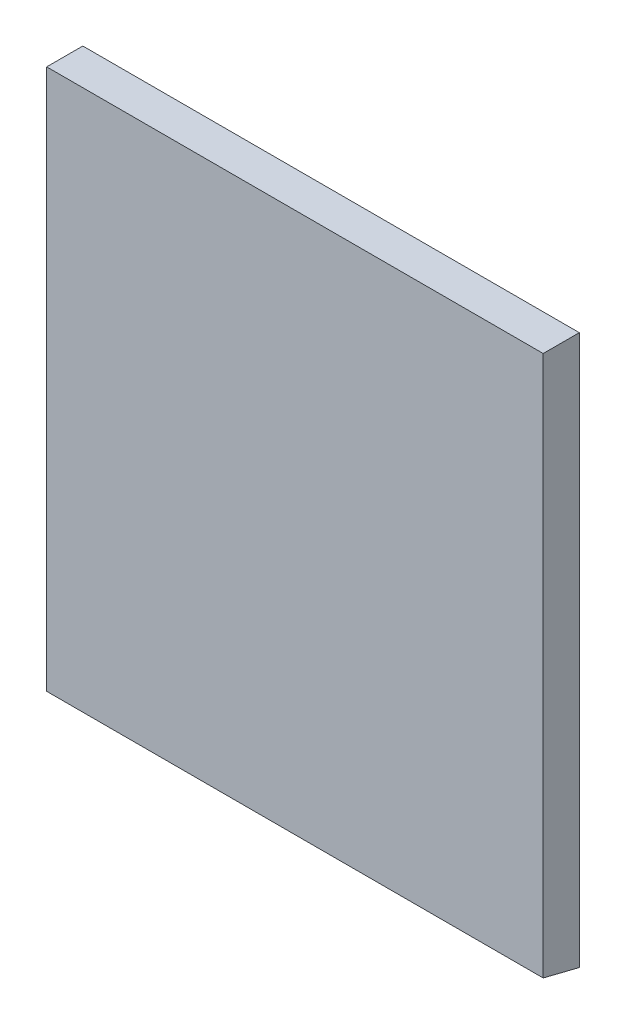
ISO-10303-21;
HEADER;
FILE_DESCRIPTION(('STEP AP214'),'2;1');
FILE_NAME('part.step','',(''),(''),'','','');
FILE_SCHEMA(('AUTOMOTIVE_DESIGN { 1 0 10303 214 1 1 1 1 }'));
ENDSEC;
DATA;
#1=APPLICATION_CONTEXT('core data for automotive mechanical design processes');
#2=APPLICATION_PROTOCOL_DEFINITION('international standard','automotive_design',2000,#1);
#3=PRODUCT_CONTEXT('',#1,'mechanical');
#4=PRODUCT('Part','Part','',(#3));
#5=PRODUCT_RELATED_PRODUCT_CATEGORY('part','',(#4));
#6=PRODUCT_DEFINITION_FORMATION('','',#4);
#7=PRODUCT_DEFINITION_CONTEXT('part definition',#1,'design');
#8=PRODUCT_DEFINITION('design','',#6,#7);
#9=PRODUCT_DEFINITION_SHAPE('','',#8);
#10=(LENGTH_UNIT() NAMED_UNIT(*) SI_UNIT(.MILLI.,.METRE.));
#11=(NAMED_UNIT(*) PLANE_ANGLE_UNIT() SI_UNIT($,.RADIAN.));
#12=(NAMED_UNIT(*) SI_UNIT($,.STERADIAN.) SOLID_ANGLE_UNIT());
#13=UNCERTAINTY_MEASURE_WITH_UNIT(LENGTH_MEASURE(1.E-05),#10,'distance_accuracy_value','');
#14=(GEOMETRIC_REPRESENTATION_CONTEXT(3) GLOBAL_UNCERTAINTY_ASSIGNED_CONTEXT((#13)) GLOBAL_UNIT_ASSIGNED_CONTEXT((#10,
#11,#12)) REPRESENTATION_CONTEXT('',''));
#15=CARTESIAN_POINT('',(0.,0.,0.));
#16=DIRECTION('',(0.,0.,1.));
#17=DIRECTION('',(1.,0.,0.));
#18=AXIS2_PLACEMENT_3D('',#15,#16,#17);
#19=CARTESIAN_POINT('',(43.66,106.923746647894,-143.154202423773));
#20=DIRECTION('',(0.,0.970295726275996,-0.24192189559967));
#21=DIRECTION('',(0.,0.24192189559967,0.970295726275996));
#22=AXIS2_PLACEMENT_3D('',#19,#20,#21);
#23=PLANE('',#22);
#24=DIRECTION('',(0.,-0.24192189559967,-0.970295726275996));
#25=VECTOR('',#24,1.);
#26=CARTESIAN_POINT('',(43.65,94.3012173907014,-193.780402101521));
#27=LINE('',#26,#25);
#28=CARTESIAN_POINT('',(43.65,108.506979465948,-136.804202423773));
#29=VERTEX_POINT('',#28);
#30=CARTESIAN_POINT('',(43.65,106.923746647894,-143.154202423773));
#31=VERTEX_POINT('',#30);
#32=EDGE_CURVE('E37',#29,#31,#27,.T.);
#33=ORIENTED_EDGE('',*,*,#32,.F.);
#34=DIRECTION('',(1.,0.,0.));
#35=VECTOR('',#34,1.);
#36=CARTESIAN_POINT('',(-50.,108.506979465948,-136.804202423773));
#37=LINE('',#36,#35);
#38=CARTESIAN_POINT('',(-43.65,108.506979465948,-136.804202423773));
#39=VERTEX_POINT('',#38);
#40=EDGE_CURVE('E11',#39,#29,#37,.T.);
#41=ORIENTED_EDGE('',*,*,#40,.F.);
#42=DIRECTION('',(0.,0.24192189559967,0.970295726275996));
#43=VECTOR('',#42,1.);
#44=CARTESIAN_POINT('',(-43.65,94.3012173907014,-193.780402101521));
#45=LINE('',#44,#43);
#46=CARTESIAN_POINT('',(-43.65,106.923746647894,-143.154202423773));
#47=VERTEX_POINT('',#46);
#48=EDGE_CURVE('E42',#47,#39,#45,.T.);
#49=ORIENTED_EDGE('',*,*,#48,.F.);
#50=DIRECTION('',(1.,0.,0.));
#51=VECTOR('',#50,1.);
#52=CARTESIAN_POINT('',(-50.,106.923746647894,-143.154202423773));
#53=LINE('',#52,#51);
#54=EDGE_CURVE('E100',#47,#31,#53,.T.);
#55=ORIENTED_EDGE('',*,*,#54,.T.);
#56=EDGE_LOOP('',(#33,#41,#49,#55));
#57=FACE_BOUND('',#56,.T.);
#58=ADVANCED_FACE('F34',(#57),#23,.F.);
#59=CARTESIAN_POINT('',(43.65,-0.00999999999995449,-170.265974623788));
#60=DIRECTION('',(1.,0.,0.));
#61=DIRECTION('',(0.,0.,1.));
#62=AXIS2_PLACEMENT_3D('',#59,#60,#61);
#63=PLANE('',#62);
#64=ORIENTED_EDGE('',*,*,#32,.T.);
#65=DIRECTION('',(0.,-1.,0.));
#66=VECTOR('',#65,1.);
#67=CARTESIAN_POINT('',(43.65,203.6,-143.154202423773));
#68=LINE('',#67,#66);
#69=CARTESIAN_POINT('',(43.65,203.6,-143.154202423773));
#70=VERTEX_POINT('',#69);
#71=EDGE_CURVE('E90',#70,#31,#68,.T.);
#72=ORIENTED_EDGE('',*,*,#71,.F.);
#73=DIRECTION('',(0.,0.,-1.));
#74=VECTOR('',#73,1.);
#75=CARTESIAN_POINT('',(43.65,203.6,-120.654202423773));
#76=LINE('',#75,#74);
#77=CARTESIAN_POINT('',(43.65,203.6,-136.804202423773));
#78=VERTEX_POINT('',#77);
#79=EDGE_CURVE('E79',#78,#70,#76,.T.);
#80=ORIENTED_EDGE('',*,*,#79,.F.);
#81=DIRECTION('',(0.,1.,0.));
#82=VECTOR('',#81,1.);
#83=CARTESIAN_POINT('',(43.65,0.,-136.804202423773));
#84=LINE('',#83,#82);
#85=EDGE_CURVE('E50',#29,#78,#84,.T.);
#86=ORIENTED_EDGE('',*,*,#85,.F.);
#87=EDGE_LOOP('',(#64,#72,#80,#86));
#88=FACE_BOUND('',#87,.T.);
#89=ADVANCED_FACE('F89',(#88),#63,.T.);
#90=CARTESIAN_POINT('',(-43.65,-0.00999999999995449,-170.265974623788));
#91=DIRECTION('',(-1.,0.,0.));
#92=DIRECTION('',(0.,0.,-1.));
#93=AXIS2_PLACEMENT_3D('',#90,#91,#92);
#94=PLANE('',#93);
#95=ORIENTED_EDGE('',*,*,#48,.T.);
#96=DIRECTION('',(0.,1.,0.));
#97=VECTOR('',#96,1.);
#98=CARTESIAN_POINT('',(-43.65,0.,-136.804202423773));
#99=LINE('',#98,#97);
#100=CARTESIAN_POINT('',(-43.65,203.6,-136.804202423773));
#101=VERTEX_POINT('',#100);
#102=EDGE_CURVE('E56',#39,#101,#99,.T.);
#103=ORIENTED_EDGE('',*,*,#102,.T.);
#104=DIRECTION('',(0.,0.,1.));
#105=VECTOR('',#104,1.);
#106=CARTESIAN_POINT('',(-43.65,203.6,-120.654202423773));
#107=LINE('',#106,#105);
#108=CARTESIAN_POINT('',(-43.65,203.6,-143.154202423773));
#109=VERTEX_POINT('',#108);
#110=EDGE_CURVE('E82',#109,#101,#107,.T.);
#111=ORIENTED_EDGE('',*,*,#110,.F.);
#112=DIRECTION('',(0.,1.,0.));
#113=VECTOR('',#112,1.);
#114=CARTESIAN_POINT('',(-43.65,203.6,-143.154202423773));
#115=LINE('',#114,#113);
#116=EDGE_CURVE('E91',#47,#109,#115,.T.);
#117=ORIENTED_EDGE('',*,*,#116,.F.);
#118=EDGE_LOOP('',(#95,#103,#111,#117));
#119=FACE_BOUND('',#118,.T.);
#120=ADVANCED_FACE('F106',(#119),#94,.T.);
#121=CARTESIAN_POINT('',(-50.,203.6,-143.154202423773));
#122=DIRECTION('',(0.,0.,1.));
#123=DIRECTION('',(0.,-1.,0.));
#124=AXIS2_PLACEMENT_3D('',#121,#122,#123);
#125=PLANE('',#124);
#126=ORIENTED_EDGE('',*,*,#71,.T.);
#127=ORIENTED_EDGE('',*,*,#54,.F.);
#128=ORIENTED_EDGE('',*,*,#116,.T.);
#129=DIRECTION('',(1.,0.,0.));
#130=VECTOR('',#129,1.);
#131=CARTESIAN_POINT('',(-50.,203.6,-143.154202423773));
#132=LINE('',#131,#130);
#133=EDGE_CURVE('E83',#109,#70,#132,.T.);
#134=ORIENTED_EDGE('',*,*,#133,.T.);
#135=EDGE_LOOP('',(#126,#127,#128,#134));
#136=FACE_BOUND('',#135,.T.);
#137=ADVANCED_FACE('F108',(#136),#125,.F.);
#138=CARTESIAN_POINT('',(-50.,203.6,-120.654202423773));
#139=DIRECTION('',(0.,-1.,0.));
#140=DIRECTION('',(0.,0.,-1.));
#141=AXIS2_PLACEMENT_3D('',#138,#139,#140);
#142=PLANE('',#141);
#143=ORIENTED_EDGE('',*,*,#79,.T.);
#144=ORIENTED_EDGE('',*,*,#133,.F.);
#145=ORIENTED_EDGE('',*,*,#110,.T.);
#146=DIRECTION('',(1.,0.,0.));
#147=VECTOR('',#146,1.);
#148=CARTESIAN_POINT('',(-50.,203.6,-136.804202423773));
#149=LINE('',#148,#147);
#150=EDGE_CURVE('E77',#101,#78,#149,.T.);
#151=ORIENTED_EDGE('',*,*,#150,.T.);
#152=EDGE_LOOP('',(#143,#144,#145,#151));
#153=FACE_BOUND('',#152,.T.);
#154=ADVANCED_FACE('F78',(#153),#142,.F.);
#155=CARTESIAN_POINT('',(-50.,203.6,-136.804202423773));
#156=DIRECTION('',(0.,0.,1.));
#157=DIRECTION('',(0.,-1.,0.));
#158=AXIS2_PLACEMENT_3D('',#155,#156,#157);
#159=PLANE('',#158);
#160=ORIENTED_EDGE('',*,*,#85,.T.);
#161=ORIENTED_EDGE('',*,*,#150,.F.);
#162=ORIENTED_EDGE('',*,*,#102,.F.);
#163=ORIENTED_EDGE('',*,*,#40,.T.);
#164=EDGE_LOOP('',(#160,#161,#162,#163));
#165=FACE_BOUND('',#164,.T.);
#166=ADVANCED_FACE('F85',(#165),#159,.T.);
#167=CLOSED_SHELL('',(#58,#89,#120,#137,#154,#166));
#168=MANIFOLD_SOLID_BREP('B2',#167);
#169=ADVANCED_BREP_SHAPE_REPRESENTATION('',(#18,#168),#14);
#170=SHAPE_DEFINITION_REPRESENTATION(#9,#169);
ENDSEC;
END-ISO-10303-21;
